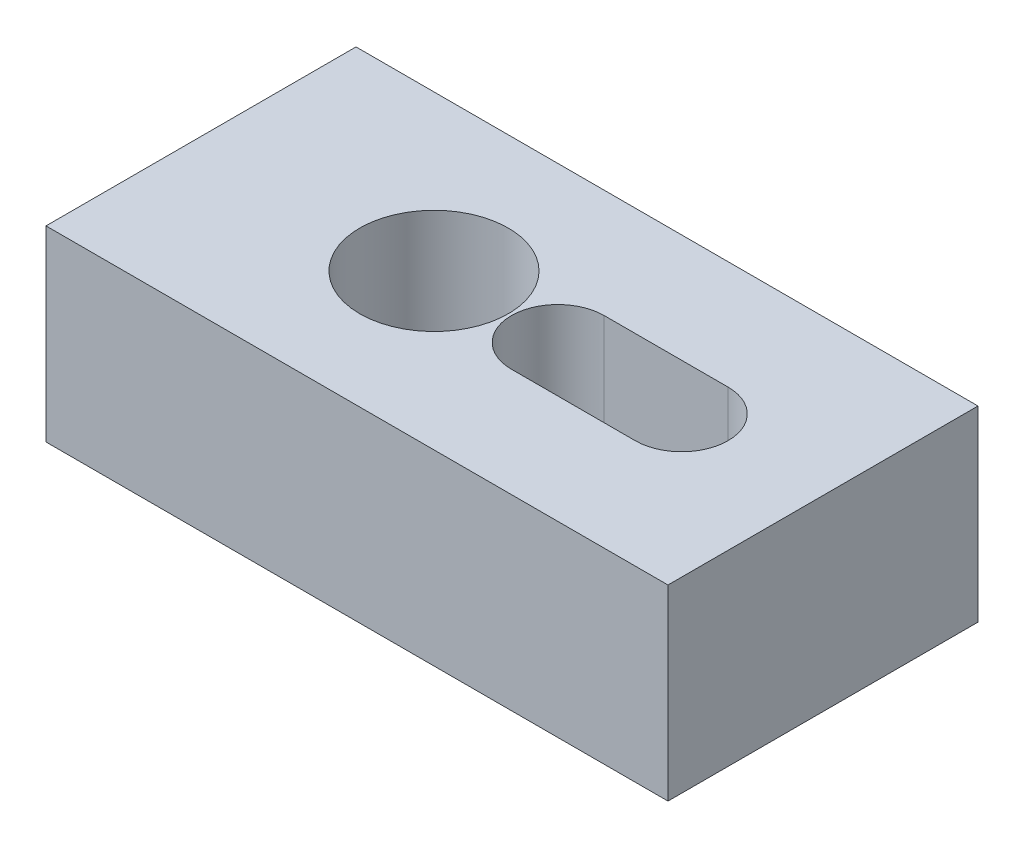
ISO-10303-21;
HEADER;
FILE_DESCRIPTION(('STEP AP214'),'2;1');
FILE_NAME('part.step','',(''),(''),'','','');
FILE_SCHEMA(('AUTOMOTIVE_DESIGN { 1 0 10303 214 1 1 1 1 }'));
ENDSEC;
DATA;
#1=APPLICATION_CONTEXT('core data for automotive mechanical design processes');
#2=APPLICATION_PROTOCOL_DEFINITION('international standard','automotive_design',2000,#1);
#3=PRODUCT_CONTEXT('',#1,'mechanical');
#4=PRODUCT('Part','Part','',(#3));
#5=PRODUCT_RELATED_PRODUCT_CATEGORY('part','',(#4));
#6=PRODUCT_DEFINITION_FORMATION('','',#4);
#7=PRODUCT_DEFINITION_CONTEXT('part definition',#1,'design');
#8=PRODUCT_DEFINITION('design','',#6,#7);
#9=PRODUCT_DEFINITION_SHAPE('','',#8);
#10=(LENGTH_UNIT() NAMED_UNIT(*) SI_UNIT(.MILLI.,.METRE.));
#11=(NAMED_UNIT(*) PLANE_ANGLE_UNIT() SI_UNIT($,.RADIAN.));
#12=(NAMED_UNIT(*) SI_UNIT($,.STERADIAN.) SOLID_ANGLE_UNIT());
#13=UNCERTAINTY_MEASURE_WITH_UNIT(LENGTH_MEASURE(1.E-05),#10,'distance_accuracy_value','');
#14=(GEOMETRIC_REPRESENTATION_CONTEXT(3) GLOBAL_UNCERTAINTY_ASSIGNED_CONTEXT((#13)) GLOBAL_UNIT_ASSIGNED_CONTEXT((#10,
#11,#12)) REPRESENTATION_CONTEXT('',''));
#15=CARTESIAN_POINT('',(0.,0.,0.));
#16=DIRECTION('',(0.,0.,1.));
#17=DIRECTION('',(1.,0.,0.));
#18=AXIS2_PLACEMENT_3D('',#15,#16,#17);
#19=CARTESIAN_POINT('',(-76.9755430359751,19.2,-30.0550002127801));
#20=DIRECTION('',(0.,1.,0.));
#21=DIRECTION('',(0.,0.,1.));
#22=AXIS2_PLACEMENT_3D('',#19,#20,#21);
#23=PLANE('',#22);
#24=CARTESIAN_POINT('',(-53.0755430359751,19.2,-45.9550002127801));
#25=DIRECTION('',(0.,1.,0.));
#26=DIRECTION('',(0.,0.,1.));
#27=AXIS2_PLACEMENT_3D('',#24,#25,#26);
#28=CIRCLE('',#27,7.62);
#29=CARTESIAN_POINT('',(-53.0755430359751,19.2,-38.3350002127801));
#30=VERTEX_POINT('',#29);
#31=EDGE_CURVE('E134',#30,#30,#28,.T.);
#32=ORIENTED_EDGE('',*,*,#31,.F.);
#33=EDGE_LOOP('',(#32));
#34=FACE_BOUND('',#33,.T.);
#35=DIRECTION('',(0.,0.,1.));
#36=VECTOR('',#35,1.);
#37=CARTESIAN_POINT('',(-76.9755430359751,19.2,-61.8550002127801));
#38=LINE('',#37,#36);
#39=CARTESIAN_POINT('',(-76.9755430359751,19.2,-61.8550002127801));
#40=VERTEX_POINT('',#39);
#41=CARTESIAN_POINT('',(-76.9755430359751,19.2,-30.0550002127801));
#42=VERTEX_POINT('',#41);
#43=EDGE_CURVE('E140',#40,#42,#38,.T.);
#44=ORIENTED_EDGE('',*,*,#43,.T.);
#45=DIRECTION('',(1.,0.,0.));
#46=VECTOR('',#45,1.);
#47=CARTESIAN_POINT('',(-76.9755430359751,19.2,-30.0550002127801));
#48=LINE('',#47,#46);
#49=CARTESIAN_POINT('',(-13.1755430359751,19.2,-30.0550002127801));
#50=VERTEX_POINT('',#49);
#51=EDGE_CURVE('E143',#42,#50,#48,.T.);
#52=ORIENTED_EDGE('',*,*,#51,.T.);
#53=DIRECTION('',(0.,0.,-1.));
#54=VECTOR('',#53,1.);
#55=CARTESIAN_POINT('',(-13.1755430359751,19.2,-61.8550002127801));
#56=LINE('',#55,#54);
#57=CARTESIAN_POINT('',(-13.1755430359751,19.2,-61.8550002127801));
#58=VERTEX_POINT('',#57);
#59=EDGE_CURVE('E146',#50,#58,#56,.T.);
#60=ORIENTED_EDGE('',*,*,#59,.T.);
#61=DIRECTION('',(-1.,0.,0.));
#62=VECTOR('',#61,1.);
#63=CARTESIAN_POINT('',(-76.9755430359751,19.2,-61.8550002127801));
#64=LINE('',#63,#62);
#65=EDGE_CURVE('E148',#58,#40,#64,.T.);
#66=ORIENTED_EDGE('',*,*,#65,.T.);
#67=EDGE_LOOP('',(#44,#52,#60,#66));
#68=FACE_BOUND('',#67,.T.);
#69=DIRECTION('',(1.,0.,0.));
#70=VECTOR('',#69,1.);
#71=CARTESIAN_POINT('',(-40.3755430359751,19.2,-41.1925002127801));
#72=LINE('',#71,#70);
#73=CARTESIAN_POINT('',(-40.3755430359751,19.2,-41.1925002127801));
#74=VERTEX_POINT('',#73);
#75=CARTESIAN_POINT('',(-27.6755430359751,19.2,-41.1925002127801));
#76=VERTEX_POINT('',#75);
#77=EDGE_CURVE('E106',#74,#76,#72,.T.);
#78=ORIENTED_EDGE('',*,*,#77,.F.);
#79=CARTESIAN_POINT('',(-40.3755430359751,19.2,-45.9550002127801));
#80=DIRECTION('',(0.,1.,0.));
#81=DIRECTION('',(0.,0.,1.));
#82=AXIS2_PLACEMENT_3D('',#79,#80,#81);
#83=CIRCLE('',#82,4.7625);
#84=CARTESIAN_POINT('',(-40.3755430359751,19.2,-50.7175002127801));
#85=VERTEX_POINT('',#84);
#86=EDGE_CURVE('E98',#85,#74,#83,.T.);
#87=ORIENTED_EDGE('',*,*,#86,.F.);
#88=DIRECTION('',(-1.,0.,0.));
#89=VECTOR('',#88,1.);
#90=CARTESIAN_POINT('',(-40.3755430359751,19.2,-50.7175002127801));
#91=LINE('',#90,#89);
#92=CARTESIAN_POINT('',(-27.6755430359751,19.2,-50.7175002127801));
#93=VERTEX_POINT('',#92);
#94=EDGE_CURVE('E120',#93,#85,#91,.T.);
#95=ORIENTED_EDGE('',*,*,#94,.F.);
#96=CARTESIAN_POINT('',(-27.6755430359751,19.2,-45.9550002127801));
#97=DIRECTION('',(0.,1.,0.));
#98=DIRECTION('',(0.,0.,1.));
#99=AXIS2_PLACEMENT_3D('',#96,#97,#98);
#100=CIRCLE('',#99,4.7625);
#101=EDGE_CURVE('E118',#76,#93,#100,.T.);
#102=ORIENTED_EDGE('',*,*,#101,.F.);
#103=EDGE_LOOP('',(#78,#87,#95,#102));
#104=FACE_BOUND('',#103,.T.);
#105=ADVANCED_FACE('F33',(#34,#68,#104),#23,.T.);
#106=CARTESIAN_POINT('',(-76.9755430359751,0.,-30.0550002127801));
#107=DIRECTION('',(0.,1.,0.));
#108=DIRECTION('',(0.,0.,1.));
#109=AXIS2_PLACEMENT_3D('',#106,#107,#108);
#110=PLANE('',#109);
#111=CARTESIAN_POINT('',(-53.0755430359751,0.,-45.9550002127801));
#112=DIRECTION('',(0.,1.,0.));
#113=DIRECTION('',(0.,0.,1.));
#114=AXIS2_PLACEMENT_3D('',#111,#112,#113);
#115=CIRCLE('',#114,7.62);
#116=CARTESIAN_POINT('',(-53.0755430359751,0.,-38.3350002127801));
#117=VERTEX_POINT('',#116);
#118=EDGE_CURVE('E114',#117,#117,#115,.T.);
#119=ORIENTED_EDGE('',*,*,#118,.T.);
#120=EDGE_LOOP('',(#119));
#121=FACE_BOUND('',#120,.T.);
#122=DIRECTION('',(0.,0.,1.));
#123=VECTOR('',#122,1.);
#124=CARTESIAN_POINT('',(-76.9755430359751,0.,-61.8550002127801));
#125=LINE('',#124,#123);
#126=CARTESIAN_POINT('',(-76.9755430359751,0.,-61.8550002127801));
#127=VERTEX_POINT('',#126);
#128=CARTESIAN_POINT('',(-76.9755430359751,0.,-30.0550002127801));
#129=VERTEX_POINT('',#128);
#130=EDGE_CURVE('E137',#127,#129,#125,.T.);
#131=ORIENTED_EDGE('',*,*,#130,.F.);
#132=DIRECTION('',(-1.,0.,0.));
#133=VECTOR('',#132,1.);
#134=CARTESIAN_POINT('',(-76.9755430359751,0.,-61.8550002127801));
#135=LINE('',#134,#133);
#136=CARTESIAN_POINT('',(-13.1755430359751,0.,-61.8550002127801));
#137=VERTEX_POINT('',#136);
#138=EDGE_CURVE('E144',#137,#127,#135,.T.);
#139=ORIENTED_EDGE('',*,*,#138,.F.);
#140=DIRECTION('',(0.,0.,-1.));
#141=VECTOR('',#140,1.);
#142=CARTESIAN_POINT('',(-13.1755430359751,0.,-61.8550002127801));
#143=LINE('',#142,#141);
#144=CARTESIAN_POINT('',(-13.1755430359751,0.,-30.0550002127801));
#145=VERTEX_POINT('',#144);
#146=EDGE_CURVE('E155',#145,#137,#143,.T.);
#147=ORIENTED_EDGE('',*,*,#146,.F.);
#148=DIRECTION('',(1.,0.,0.));
#149=VECTOR('',#148,1.);
#150=CARTESIAN_POINT('',(-76.9755430359751,0.,-30.0550002127801));
#151=LINE('',#150,#149);
#152=EDGE_CURVE('E153',#129,#145,#151,.T.);
#153=ORIENTED_EDGE('',*,*,#152,.F.);
#154=EDGE_LOOP('',(#131,#139,#147,#153));
#155=FACE_BOUND('',#154,.T.);
#156=CARTESIAN_POINT('',(-40.3755430359751,0.,-45.9550002127801));
#157=DIRECTION('',(0.,1.,0.));
#158=DIRECTION('',(0.,0.,1.));
#159=AXIS2_PLACEMENT_3D('',#156,#157,#158);
#160=CIRCLE('',#159,4.7625);
#161=CARTESIAN_POINT('',(-40.3755430359751,0.,-50.7175002127801));
#162=VERTEX_POINT('',#161);
#163=CARTESIAN_POINT('',(-40.3755430359751,0.,-41.1925002127801));
#164=VERTEX_POINT('',#163);
#165=EDGE_CURVE('E56',#162,#164,#160,.T.);
#166=ORIENTED_EDGE('',*,*,#165,.T.);
#167=DIRECTION('',(1.,0.,0.));
#168=VECTOR('',#167,1.);
#169=CARTESIAN_POINT('',(-40.3755430359751,0.,-41.1925002127801));
#170=LINE('',#169,#168);
#171=CARTESIAN_POINT('',(-27.6755430359751,0.,-41.1925002127801));
#172=VERTEX_POINT('',#171);
#173=EDGE_CURVE('E113',#164,#172,#170,.T.);
#174=ORIENTED_EDGE('',*,*,#173,.T.);
#175=CARTESIAN_POINT('',(-27.6755430359751,0.,-45.9550002127801));
#176=DIRECTION('',(0.,1.,0.));
#177=DIRECTION('',(0.,0.,1.));
#178=AXIS2_PLACEMENT_3D('',#175,#176,#177);
#179=CIRCLE('',#178,4.7625);
#180=CARTESIAN_POINT('',(-27.6755430359751,0.,-50.7175002127801));
#181=VERTEX_POINT('',#180);
#182=EDGE_CURVE('E126',#172,#181,#179,.T.);
#183=ORIENTED_EDGE('',*,*,#182,.T.);
#184=DIRECTION('',(-1.,0.,0.));
#185=VECTOR('',#184,1.);
#186=CARTESIAN_POINT('',(-40.3755430359751,0.,-50.7175002127801));
#187=LINE('',#186,#185);
#188=EDGE_CURVE('E107',#181,#162,#187,.T.);
#189=ORIENTED_EDGE('',*,*,#188,.T.);
#190=EDGE_LOOP('',(#166,#174,#183,#189));
#191=FACE_BOUND('',#190,.T.);
#192=ADVANCED_FACE('F173',(#121,#155,#191),#110,.F.);
#193=CARTESIAN_POINT('',(-76.9755430359751,19.2,-61.8550002127801));
#194=DIRECTION('',(1.,0.,0.));
#195=DIRECTION('',(0.,0.,-1.));
#196=AXIS2_PLACEMENT_3D('',#193,#194,#195);
#197=PLANE('',#196);
#198=ORIENTED_EDGE('',*,*,#130,.T.);
#199=DIRECTION('',(0.,-1.,0.));
#200=VECTOR('',#199,1.);
#201=CARTESIAN_POINT('',(-76.9755430359751,19.2,-30.0550002127801));
#202=LINE('',#201,#200);
#203=EDGE_CURVE('E11',#42,#129,#202,.T.);
#204=ORIENTED_EDGE('',*,*,#203,.F.);
#205=ORIENTED_EDGE('',*,*,#43,.F.);
#206=DIRECTION('',(0.,-1.,0.));
#207=VECTOR('',#206,1.);
#208=CARTESIAN_POINT('',(-76.9755430359751,19.2,-61.8550002127801));
#209=LINE('',#208,#207);
#210=EDGE_CURVE('E150',#40,#127,#209,.T.);
#211=ORIENTED_EDGE('',*,*,#210,.T.);
#212=EDGE_LOOP('',(#198,#204,#205,#211));
#213=FACE_BOUND('',#212,.T.);
#214=ADVANCED_FACE('F35',(#213),#197,.F.);
#215=CARTESIAN_POINT('',(-76.9755430359751,19.2,-30.0550002127801));
#216=DIRECTION('',(0.,0.,-1.));
#217=DIRECTION('',(-1.,0.,0.));
#218=AXIS2_PLACEMENT_3D('',#215,#216,#217);
#219=PLANE('',#218);
#220=ORIENTED_EDGE('',*,*,#152,.T.);
#221=DIRECTION('',(0.,-1.,0.));
#222=VECTOR('',#221,1.);
#223=CARTESIAN_POINT('',(-13.1755430359751,19.2,-30.0550002127801));
#224=LINE('',#223,#222);
#225=EDGE_CURVE('E41',#50,#145,#224,.T.);
#226=ORIENTED_EDGE('',*,*,#225,.F.);
#227=ORIENTED_EDGE('',*,*,#51,.F.);
#228=ORIENTED_EDGE('',*,*,#203,.T.);
#229=EDGE_LOOP('',(#220,#226,#227,#228));
#230=FACE_BOUND('',#229,.T.);
#231=ADVANCED_FACE('F183',(#230),#219,.F.);
#232=CARTESIAN_POINT('',(-13.1755430359751,19.2,-61.8550002127801));
#233=DIRECTION('',(-1.,0.,0.));
#234=DIRECTION('',(0.,0.,1.));
#235=AXIS2_PLACEMENT_3D('',#232,#233,#234);
#236=PLANE('',#235);
#237=ORIENTED_EDGE('',*,*,#146,.T.);
#238=DIRECTION('',(0.,-1.,0.));
#239=VECTOR('',#238,1.);
#240=CARTESIAN_POINT('',(-13.1755430359751,19.2,-61.8550002127801));
#241=LINE('',#240,#239);
#242=EDGE_CURVE('E160',#58,#137,#241,.T.);
#243=ORIENTED_EDGE('',*,*,#242,.F.);
#244=ORIENTED_EDGE('',*,*,#59,.F.);
#245=ORIENTED_EDGE('',*,*,#225,.T.);
#246=EDGE_LOOP('',(#237,#243,#244,#245));
#247=FACE_BOUND('',#246,.T.);
#248=ADVANCED_FACE('F167',(#247),#236,.F.);
#249=CARTESIAN_POINT('',(-76.9755430359751,19.2,-61.8550002127801));
#250=DIRECTION('',(0.,0.,1.));
#251=DIRECTION('',(1.,0.,0.));
#252=AXIS2_PLACEMENT_3D('',#249,#250,#251);
#253=PLANE('',#252);
#254=ORIENTED_EDGE('',*,*,#138,.T.);
#255=ORIENTED_EDGE('',*,*,#210,.F.);
#256=ORIENTED_EDGE('',*,*,#65,.F.);
#257=ORIENTED_EDGE('',*,*,#242,.T.);
#258=EDGE_LOOP('',(#254,#255,#256,#257));
#259=FACE_BOUND('',#258,.T.);
#260=ADVANCED_FACE('F177',(#259),#253,.F.);
#261=CARTESIAN_POINT('',(-53.0755430359751,19.2,-45.9550002127801));
#262=DIRECTION('',(0.,-1.,0.));
#263=DIRECTION('',(0.,0.,-1.));
#264=AXIS2_PLACEMENT_3D('',#261,#262,#263);
#265=CYLINDRICAL_SURFACE('',#264,7.62);
#266=ORIENTED_EDGE('',*,*,#31,.T.);
#267=EDGE_LOOP('',(#266));
#268=FACE_BOUND('',#267,.T.);
#269=ORIENTED_EDGE('',*,*,#118,.F.);
#270=EDGE_LOOP('',(#269));
#271=FACE_BOUND('',#270,.T.);
#272=ADVANCED_FACE('F200',(#268,#271),#265,.F.);
#273=CARTESIAN_POINT('',(-40.3755430359751,19.2,-45.9550002127801));
#274=DIRECTION('',(0.,-1.,0.));
#275=DIRECTION('',(0.,0.,-1.));
#276=AXIS2_PLACEMENT_3D('',#273,#274,#275);
#277=CYLINDRICAL_SURFACE('',#276,4.7625);
#278=ORIENTED_EDGE('',*,*,#165,.F.);
#279=DIRECTION('',(0.,-1.,0.));
#280=VECTOR('',#279,1.);
#281=CARTESIAN_POINT('',(-40.3755430359751,19.2,-50.7175002127801));
#282=LINE('',#281,#280);
#283=EDGE_CURVE('E102',#85,#162,#282,.T.);
#284=ORIENTED_EDGE('',*,*,#283,.F.);
#285=ORIENTED_EDGE('',*,*,#86,.T.);
#286=DIRECTION('',(0.,-1.,0.));
#287=VECTOR('',#286,1.);
#288=CARTESIAN_POINT('',(-40.3755430359751,19.2,-41.1925002127801));
#289=LINE('',#288,#287);
#290=EDGE_CURVE('E101',#74,#164,#289,.T.);
#291=ORIENTED_EDGE('',*,*,#290,.T.);
#292=EDGE_LOOP('',(#278,#284,#285,#291));
#293=FACE_BOUND('',#292,.T.);
#294=ADVANCED_FACE('F100',(#293),#277,.F.);
#295=CARTESIAN_POINT('',(-40.3755430359751,19.2,-41.1925002127801));
#296=DIRECTION('',(0.,0.,-1.));
#297=DIRECTION('',(-1.,0.,0.));
#298=AXIS2_PLACEMENT_3D('',#295,#296,#297);
#299=PLANE('',#298);
#300=ORIENTED_EDGE('',*,*,#173,.F.);
#301=ORIENTED_EDGE('',*,*,#290,.F.);
#302=ORIENTED_EDGE('',*,*,#77,.T.);
#303=DIRECTION('',(0.,-1.,0.));
#304=VECTOR('',#303,1.);
#305=CARTESIAN_POINT('',(-27.6755430359751,19.2,-41.1925002127801));
#306=LINE('',#305,#304);
#307=EDGE_CURVE('E115',#76,#172,#306,.T.);
#308=ORIENTED_EDGE('',*,*,#307,.T.);
#309=EDGE_LOOP('',(#300,#301,#302,#308));
#310=FACE_BOUND('',#309,.T.);
#311=ADVANCED_FACE('F110',(#310),#299,.T.);
#312=CARTESIAN_POINT('',(-27.6755430359751,19.2,-45.9550002127801));
#313=DIRECTION('',(0.,-1.,0.));
#314=DIRECTION('',(0.,0.,-1.));
#315=AXIS2_PLACEMENT_3D('',#312,#313,#314);
#316=CYLINDRICAL_SURFACE('',#315,4.7625);
#317=ORIENTED_EDGE('',*,*,#182,.F.);
#318=ORIENTED_EDGE('',*,*,#307,.F.);
#319=ORIENTED_EDGE('',*,*,#101,.T.);
#320=DIRECTION('',(0.,-1.,0.));
#321=VECTOR('',#320,1.);
#322=CARTESIAN_POINT('',(-27.6755430359751,19.2,-50.7175002127801));
#323=LINE('',#322,#321);
#324=EDGE_CURVE('E48',#93,#181,#323,.T.);
#325=ORIENTED_EDGE('',*,*,#324,.T.);
#326=EDGE_LOOP('',(#317,#318,#319,#325));
#327=FACE_BOUND('',#326,.T.);
#328=ADVANCED_FACE('F216',(#327),#316,.F.);
#329=CARTESIAN_POINT('',(-40.3755430359751,19.2,-50.7175002127801));
#330=DIRECTION('',(0.,0.,1.));
#331=DIRECTION('',(1.,0.,0.));
#332=AXIS2_PLACEMENT_3D('',#329,#330,#331);
#333=PLANE('',#332);
#334=ORIENTED_EDGE('',*,*,#188,.F.);
#335=ORIENTED_EDGE('',*,*,#324,.F.);
#336=ORIENTED_EDGE('',*,*,#94,.T.);
#337=ORIENTED_EDGE('',*,*,#283,.T.);
#338=EDGE_LOOP('',(#334,#335,#336,#337));
#339=FACE_BOUND('',#338,.T.);
#340=ADVANCED_FACE('F221',(#339),#333,.T.);
#341=CLOSED_SHELL('',(#105,#192,#214,#231,#248,#260,#272,#294,#311,#328,#340));
#342=MANIFOLD_SOLID_BREP('B2',#341);
#343=ADVANCED_BREP_SHAPE_REPRESENTATION('',(#18,#342),#14);
#344=SHAPE_DEFINITION_REPRESENTATION(#9,#343);
ENDSEC;
END-ISO-10303-21;
